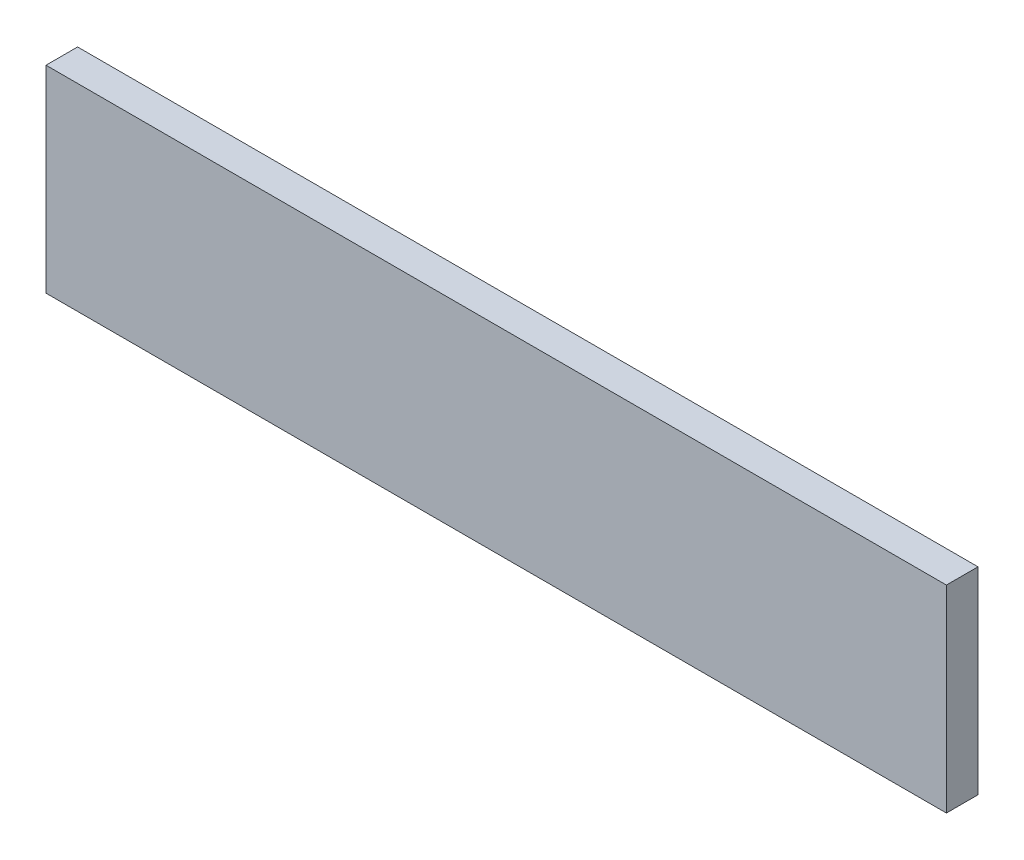
ISO-10303-21;
HEADER;
FILE_DESCRIPTION(('STEP AP214'),'2;1');
FILE_NAME('part.step','',(''),(''),'','','');
FILE_SCHEMA(('AUTOMOTIVE_DESIGN { 1 0 10303 214 1 1 1 1 }'));
ENDSEC;
DATA;
#1=APPLICATION_CONTEXT('core data for automotive mechanical design processes');
#2=APPLICATION_PROTOCOL_DEFINITION('international standard','automotive_design',2000,#1);
#3=PRODUCT_CONTEXT('',#1,'mechanical');
#4=PRODUCT('Part','Part','',(#3));
#5=PRODUCT_RELATED_PRODUCT_CATEGORY('part','',(#4));
#6=PRODUCT_DEFINITION_FORMATION('','',#4);
#7=PRODUCT_DEFINITION_CONTEXT('part definition',#1,'design');
#8=PRODUCT_DEFINITION('design','',#6,#7);
#9=PRODUCT_DEFINITION_SHAPE('','',#8);
#10=(LENGTH_UNIT() NAMED_UNIT(*) SI_UNIT(.MILLI.,.METRE.));
#11=(NAMED_UNIT(*) PLANE_ANGLE_UNIT() SI_UNIT($,.RADIAN.));
#12=(NAMED_UNIT(*) SI_UNIT($,.STERADIAN.) SOLID_ANGLE_UNIT());
#13=UNCERTAINTY_MEASURE_WITH_UNIT(LENGTH_MEASURE(1.E-05),#10,'distance_accuracy_value','');
#14=(GEOMETRIC_REPRESENTATION_CONTEXT(3) GLOBAL_UNCERTAINTY_ASSIGNED_CONTEXT((#13)) GLOBAL_UNIT_ASSIGNED_CONTEXT((#10,
#11,#12)) REPRESENTATION_CONTEXT('',''));
#15=CARTESIAN_POINT('',(0.,0.,0.));
#16=DIRECTION('',(0.,0.,1.));
#17=DIRECTION('',(1.,0.,0.));
#18=AXIS2_PLACEMENT_3D('',#15,#16,#17);
#19=CARTESIAN_POINT('',(0.,0.,-40.));
#20=DIRECTION('',(-1.,0.,0.));
#21=DIRECTION('',(0.,-1.,0.));
#22=AXIS2_PLACEMENT_3D('',#19,#20,#21);
#23=PLANE('',#22);
#24=DIRECTION('',(0.,-1.,0.));
#25=VECTOR('',#24,1.);
#26=CARTESIAN_POINT('',(0.,0.,0.));
#27=LINE('',#26,#25);
#28=CARTESIAN_POINT('',(0.,0.,0.));
#29=VERTEX_POINT('',#28);
#30=CARTESIAN_POINT('',(0.,-250.,0.));
#31=VERTEX_POINT('',#30);
#32=EDGE_CURVE('E102',#29,#31,#27,.T.);
#33=ORIENTED_EDGE('',*,*,#32,.F.);
#34=DIRECTION('',(0.,0.,1.));
#35=VECTOR('',#34,1.);
#36=CARTESIAN_POINT('',(0.,0.,-40.));
#37=LINE('',#36,#35);
#38=CARTESIAN_POINT('',(0.,0.,-40.));
#39=VERTEX_POINT('',#38);
#40=EDGE_CURVE('E11',#39,#29,#37,.T.);
#41=ORIENTED_EDGE('',*,*,#40,.F.);
#42=DIRECTION('',(0.,-1.,0.));
#43=VECTOR('',#42,1.);
#44=CARTESIAN_POINT('',(0.,0.,-40.));
#45=LINE('',#44,#43);
#46=CARTESIAN_POINT('',(0.,-250.,-40.));
#47=VERTEX_POINT('',#46);
#48=EDGE_CURVE('E96',#39,#47,#45,.T.);
#49=ORIENTED_EDGE('',*,*,#48,.T.);
#50=DIRECTION('',(0.,0.,1.));
#51=VECTOR('',#50,1.);
#52=CARTESIAN_POINT('',(0.,-250.,-40.));
#53=LINE('',#52,#51);
#54=EDGE_CURVE('E41',#47,#31,#53,.T.);
#55=ORIENTED_EDGE('',*,*,#54,.T.);
#56=EDGE_LOOP('',(#33,#41,#49,#55));
#57=FACE_BOUND('',#56,.T.);
#58=ADVANCED_FACE('F38',(#57),#23,.T.);
#59=CARTESIAN_POINT('',(0.,0.,-40.));
#60=DIRECTION('',(0.,1.,0.));
#61=DIRECTION('',(0.,0.,1.));
#62=AXIS2_PLACEMENT_3D('',#59,#60,#61);
#63=PLANE('',#62);
#64=DIRECTION('',(-1.,0.,0.));
#65=VECTOR('',#64,1.);
#66=CARTESIAN_POINT('',(0.,0.,0.));
#67=LINE('',#66,#65);
#68=CARTESIAN_POINT('',(1140.,0.,0.));
#69=VERTEX_POINT('',#68);
#70=EDGE_CURVE('E98',#69,#29,#67,.T.);
#71=ORIENTED_EDGE('',*,*,#70,.F.);
#72=DIRECTION('',(0.,0.,1.));
#73=VECTOR('',#72,1.);
#74=CARTESIAN_POINT('',(1140.,0.,-40.));
#75=LINE('',#74,#73);
#76=CARTESIAN_POINT('',(1140.,0.,-40.));
#77=VERTEX_POINT('',#76);
#78=EDGE_CURVE('E47',#77,#69,#75,.T.);
#79=ORIENTED_EDGE('',*,*,#78,.F.);
#80=DIRECTION('',(-1.,0.,0.));
#81=VECTOR('',#80,1.);
#82=CARTESIAN_POINT('',(0.,0.,-40.));
#83=LINE('',#82,#81);
#84=EDGE_CURVE('E93',#77,#39,#83,.T.);
#85=ORIENTED_EDGE('',*,*,#84,.T.);
#86=ORIENTED_EDGE('',*,*,#40,.T.);
#87=EDGE_LOOP('',(#71,#79,#85,#86));
#88=FACE_BOUND('',#87,.T.);
#89=ADVANCED_FACE('F112',(#88),#63,.T.);
#90=CARTESIAN_POINT('',(1140.,0.,-40.));
#91=DIRECTION('',(1.,0.,0.));
#92=DIRECTION('',(0.,0.,-1.));
#93=AXIS2_PLACEMENT_3D('',#90,#91,#92);
#94=PLANE('',#93);
#95=DIRECTION('',(0.,1.,0.));
#96=VECTOR('',#95,1.);
#97=CARTESIAN_POINT('',(1140.,0.,0.));
#98=LINE('',#97,#96);
#99=CARTESIAN_POINT('',(1140.,-250.,0.));
#100=VERTEX_POINT('',#99);
#101=EDGE_CURVE('E88',#100,#69,#98,.T.);
#102=ORIENTED_EDGE('',*,*,#101,.F.);
#103=DIRECTION('',(0.,0.,1.));
#104=VECTOR('',#103,1.);
#105=CARTESIAN_POINT('',(1140.,-250.,-40.));
#106=LINE('',#105,#104);
#107=CARTESIAN_POINT('',(1140.,-250.,-40.));
#108=VERTEX_POINT('',#107);
#109=EDGE_CURVE('E83',#108,#100,#106,.T.);
#110=ORIENTED_EDGE('',*,*,#109,.F.);
#111=DIRECTION('',(0.,1.,0.));
#112=VECTOR('',#111,1.);
#113=CARTESIAN_POINT('',(1140.,0.,-40.));
#114=LINE('',#113,#112);
#115=EDGE_CURVE('E86',#108,#77,#114,.T.);
#116=ORIENTED_EDGE('',*,*,#115,.T.);
#117=ORIENTED_EDGE('',*,*,#78,.T.);
#118=EDGE_LOOP('',(#102,#110,#116,#117));
#119=FACE_BOUND('',#118,.T.);
#120=ADVANCED_FACE('F85',(#119),#94,.T.);
#121=CARTESIAN_POINT('',(0.,-250.,-40.));
#122=DIRECTION('',(0.,-1.,0.));
#123=DIRECTION('',(0.,0.,-1.));
#124=AXIS2_PLACEMENT_3D('',#121,#122,#123);
#125=PLANE('',#124);
#126=DIRECTION('',(1.,0.,0.));
#127=VECTOR('',#126,1.);
#128=CARTESIAN_POINT('',(0.,-250.,0.));
#129=LINE('',#128,#127);
#130=EDGE_CURVE('E105',#31,#100,#129,.T.);
#131=ORIENTED_EDGE('',*,*,#130,.F.);
#132=ORIENTED_EDGE('',*,*,#54,.F.);
#133=DIRECTION('',(1.,0.,0.));
#134=VECTOR('',#133,1.);
#135=CARTESIAN_POINT('',(0.,-250.,-40.));
#136=LINE('',#135,#134);
#137=EDGE_CURVE('E92',#47,#108,#136,.T.);
#138=ORIENTED_EDGE('',*,*,#137,.T.);
#139=ORIENTED_EDGE('',*,*,#109,.T.);
#140=EDGE_LOOP('',(#131,#132,#138,#139));
#141=FACE_BOUND('',#140,.T.);
#142=ADVANCED_FACE('F95',(#141),#125,.T.);
#143=CARTESIAN_POINT('',(0.,0.,-40.));
#144=DIRECTION('',(0.,0.,1.));
#145=DIRECTION('',(1.,0.,0.));
#146=AXIS2_PLACEMENT_3D('',#143,#144,#145);
#147=PLANE('',#146);
#148=ORIENTED_EDGE('',*,*,#48,.F.);
#149=ORIENTED_EDGE('',*,*,#84,.F.);
#150=ORIENTED_EDGE('',*,*,#115,.F.);
#151=ORIENTED_EDGE('',*,*,#137,.F.);
#152=EDGE_LOOP('',(#148,#149,#150,#151));
#153=FACE_BOUND('',#152,.T.);
#154=ADVANCED_FACE('F91',(#153),#147,.F.);
#155=CARTESIAN_POINT('',(0.,0.,0.));
#156=DIRECTION('',(0.,0.,1.));
#157=DIRECTION('',(1.,0.,0.));
#158=AXIS2_PLACEMENT_3D('',#155,#156,#157);
#159=PLANE('',#158);
#160=ORIENTED_EDGE('',*,*,#32,.T.);
#161=ORIENTED_EDGE('',*,*,#130,.T.);
#162=ORIENTED_EDGE('',*,*,#101,.T.);
#163=ORIENTED_EDGE('',*,*,#70,.T.);
#164=EDGE_LOOP('',(#160,#161,#162,#163));
#165=FACE_BOUND('',#164,.T.);
#166=ADVANCED_FACE('F111',(#165),#159,.T.);
#167=CLOSED_SHELL('',(#58,#89,#120,#142,#154,#166));
#168=MANIFOLD_SOLID_BREP('B2',#167);
#169=ADVANCED_BREP_SHAPE_REPRESENTATION('',(#18,#168),#14);
#170=SHAPE_DEFINITION_REPRESENTATION(#9,#169);
ENDSEC;
END-ISO-10303-21;
